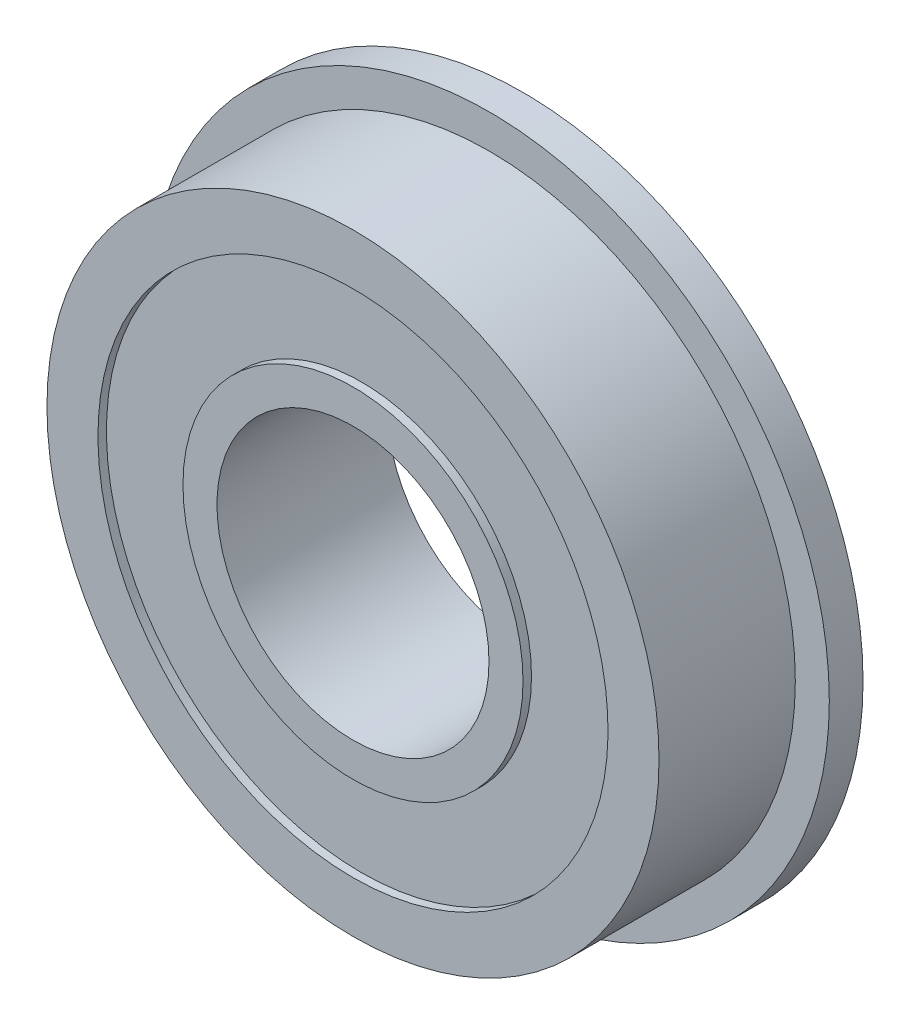
ISO-10303-21;
HEADER;
FILE_DESCRIPTION(('STEP AP214'),'2;1');
FILE_NAME('part.step','',(''),(''),'','','');
FILE_SCHEMA(('AUTOMOTIVE_DESIGN { 1 0 10303 214 1 1 1 1 }'));
ENDSEC;
DATA;
#1=APPLICATION_CONTEXT('core data for automotive mechanical design processes');
#2=APPLICATION_PROTOCOL_DEFINITION('international standard','automotive_design',2000,#1);
#3=PRODUCT_CONTEXT('',#1,'mechanical');
#4=PRODUCT('Part','Part','',(#3));
#5=PRODUCT_RELATED_PRODUCT_CATEGORY('part','',(#4));
#6=PRODUCT_DEFINITION_FORMATION('','',#4);
#7=PRODUCT_DEFINITION_CONTEXT('part definition',#1,'design');
#8=PRODUCT_DEFINITION('design','',#6,#7);
#9=PRODUCT_DEFINITION_SHAPE('','',#8);
#10=(LENGTH_UNIT() NAMED_UNIT(*) SI_UNIT(.MILLI.,.METRE.));
#11=(NAMED_UNIT(*) PLANE_ANGLE_UNIT() SI_UNIT($,.RADIAN.));
#12=(NAMED_UNIT(*) SI_UNIT($,.STERADIAN.) SOLID_ANGLE_UNIT());
#13=UNCERTAINTY_MEASURE_WITH_UNIT(LENGTH_MEASURE(1.E-05),#10,'distance_accuracy_value','');
#14=(GEOMETRIC_REPRESENTATION_CONTEXT(3) GLOBAL_UNCERTAINTY_ASSIGNED_CONTEXT((#13)) GLOBAL_UNIT_ASSIGNED_CONTEXT((#10,
#11,#12)) REPRESENTATION_CONTEXT('',''));
#15=CARTESIAN_POINT('',(0.,0.,0.));
#16=DIRECTION('',(0.,0.,1.));
#17=DIRECTION('',(1.,0.,0.));
#18=AXIS2_PLACEMENT_3D('',#15,#16,#17);
#19=CARTESIAN_POINT('',(0.,0.,-3.96875));
#20=DIRECTION('',(0.,0.,-1.));
#21=DIRECTION('',(0.,-1.,0.));
#22=AXIS2_PLACEMENT_3D('',#19,#20,#21);
#23=CYLINDRICAL_SURFACE('',#22,7.9375);
#24=CARTESIAN_POINT('',(0.,0.,-3.571875));
#25=DIRECTION('',(0.,0.,1.));
#26=DIRECTION('',(1.,0.,0.));
#27=AXIS2_PLACEMENT_3D('',#24,#25,#26);
#28=CIRCLE('',#27,7.9375);
#29=CARTESIAN_POINT('',(7.9375,0.,-3.571875));
#30=VERTEX_POINT('',#29);
#31=EDGE_CURVE('E21',#30,#30,#28,.T.);
#32=ORIENTED_EDGE('',*,*,#31,.F.);
#33=EDGE_LOOP('',(#32));
#34=FACE_BOUND('',#33,.T.);
#35=CARTESIAN_POINT('',(0.,0.,-3.96875));
#36=DIRECTION('',(0.,0.,-1.));
#37=DIRECTION('',(0.,-1.,0.));
#38=AXIS2_PLACEMENT_3D('',#35,#36,#37);
#39=CIRCLE('',#38,7.9375);
#40=CARTESIAN_POINT('',(0.,-7.9375,-3.96875));
#41=VERTEX_POINT('',#40);
#42=EDGE_CURVE('E30',#41,#41,#39,.T.);
#43=ORIENTED_EDGE('',*,*,#42,.F.);
#44=EDGE_LOOP('',(#43));
#45=FACE_BOUND('',#44,.T.);
#46=ADVANCED_FACE('F13',(#34,#45),#23,.T.);
#47=CARTESIAN_POINT('',(0.,0.,-3.96875));
#48=DIRECTION('',(0.,0.,-1.));
#49=DIRECTION('',(0.,-1.,0.));
#50=AXIS2_PLACEMENT_3D('',#47,#48,#49);
#51=CYLINDRICAL_SURFACE('',#50,11.90625);
#52=CARTESIAN_POINT('',(0.,0.,-3.571875));
#53=DIRECTION('',(0.,0.,1.));
#54=DIRECTION('',(1.,0.,0.));
#55=AXIS2_PLACEMENT_3D('',#52,#53,#54);
#56=CIRCLE('',#55,11.90625);
#57=CARTESIAN_POINT('',(11.90625,0.,-3.571875));
#58=VERTEX_POINT('',#57);
#59=EDGE_CURVE('E8',#58,#58,#56,.T.);
#60=ORIENTED_EDGE('',*,*,#59,.T.);
#61=EDGE_LOOP('',(#60));
#62=FACE_BOUND('',#61,.T.);
#63=CARTESIAN_POINT('',(0.,0.,-3.96875));
#64=DIRECTION('',(0.,0.,1.));
#65=DIRECTION('',(1.,0.,0.));
#66=AXIS2_PLACEMENT_3D('',#63,#64,#65);
#67=CIRCLE('',#66,11.90625);
#68=CARTESIAN_POINT('',(11.90625,0.,-3.96875));
#69=VERTEX_POINT('',#68);
#70=EDGE_CURVE('E26',#69,#69,#67,.T.);
#71=ORIENTED_EDGE('',*,*,#70,.F.);
#72=EDGE_LOOP('',(#71));
#73=FACE_BOUND('',#72,.T.);
#74=ADVANCED_FACE('F66',(#62,#73),#51,.F.);
#75=CARTESIAN_POINT('',(0.,0.,-3.571875));
#76=DIRECTION('',(0.,0.,1.));
#77=DIRECTION('',(1.,0.,0.));
#78=AXIS2_PLACEMENT_3D('',#75,#76,#77);
#79=PLANE('',#78);
#80=ORIENTED_EDGE('',*,*,#31,.T.);
#81=EDGE_LOOP('',(#80));
#82=FACE_BOUND('',#81,.T.);
#83=ORIENTED_EDGE('',*,*,#59,.F.);
#84=EDGE_LOOP('',(#83));
#85=FACE_BOUND('',#84,.T.);
#86=ADVANCED_FACE('F73',(#82,#85),#79,.F.);
#87=CARTESIAN_POINT('',(0.,0.,-3.96875));
#88=DIRECTION('',(0.,0.,-1.));
#89=DIRECTION('',(-1.,0.,0.));
#90=AXIS2_PLACEMENT_3D('',#87,#88,#89);
#91=PLANE('',#90);
#92=CARTESIAN_POINT('',(0.,0.,-3.96875));
#93=DIRECTION('',(0.,0.,1.));
#94=DIRECTION('',(1.,0.,0.));
#95=AXIS2_PLACEMENT_3D('',#92,#93,#94);
#96=CIRCLE('',#95,15.875);
#97=CARTESIAN_POINT('',(15.875,0.,-3.96875));
#98=VERTEX_POINT('',#97);
#99=EDGE_CURVE('E34',#98,#98,#96,.T.);
#100=ORIENTED_EDGE('',*,*,#99,.F.);
#101=EDGE_LOOP('',(#100));
#102=FACE_BOUND('',#101,.T.);
#103=ORIENTED_EDGE('',*,*,#70,.T.);
#104=EDGE_LOOP('',(#103));
#105=FACE_BOUND('',#104,.T.);
#106=ADVANCED_FACE('F77',(#102,#105),#91,.T.);
#107=CARTESIAN_POINT('',(0.,0.,3.96875));
#108=DIRECTION('',(0.,0.,-1.));
#109=DIRECTION('',(0.,-1.,0.));
#110=AXIS2_PLACEMENT_3D('',#107,#108,#109);
#111=CYLINDRICAL_SURFACE('',#110,7.9375);
#112=CARTESIAN_POINT('',(0.,0.,3.571875));
#113=DIRECTION('',(0.,0.,1.));
#114=DIRECTION('',(1.,0.,0.));
#115=AXIS2_PLACEMENT_3D('',#112,#113,#114);
#116=CIRCLE('',#115,7.9375);
#117=CARTESIAN_POINT('',(7.9375,0.,3.571875));
#118=VERTEX_POINT('',#117);
#119=EDGE_CURVE('E33',#118,#118,#116,.T.);
#120=ORIENTED_EDGE('',*,*,#119,.T.);
#121=EDGE_LOOP('',(#120));
#122=FACE_BOUND('',#121,.T.);
#123=CARTESIAN_POINT('',(0.,0.,3.96875));
#124=DIRECTION('',(0.,0.,1.));
#125=DIRECTION('',(1.,0.,0.));
#126=AXIS2_PLACEMENT_3D('',#123,#124,#125);
#127=CIRCLE('',#126,7.9375);
#128=CARTESIAN_POINT('',(7.9375,0.,3.96875));
#129=VERTEX_POINT('',#128);
#130=EDGE_CURVE('E38',#129,#129,#127,.T.);
#131=ORIENTED_EDGE('',*,*,#130,.F.);
#132=EDGE_LOOP('',(#131));
#133=FACE_BOUND('',#132,.T.);
#134=ADVANCED_FACE('F80',(#122,#133),#111,.T.);
#135=CARTESIAN_POINT('',(0.,0.,3.96875));
#136=DIRECTION('',(0.,0.,-1.));
#137=DIRECTION('',(0.,-1.,0.));
#138=AXIS2_PLACEMENT_3D('',#135,#136,#137);
#139=CYLINDRICAL_SURFACE('',#138,11.90625);
#140=CARTESIAN_POINT('',(0.,0.,3.571875));
#141=DIRECTION('',(0.,0.,1.));
#142=DIRECTION('',(1.,0.,0.));
#143=AXIS2_PLACEMENT_3D('',#140,#141,#142);
#144=CIRCLE('',#143,11.90625);
#145=CARTESIAN_POINT('',(11.90625,0.,3.571875));
#146=VERTEX_POINT('',#145);
#147=EDGE_CURVE('E41',#146,#146,#144,.T.);
#148=ORIENTED_EDGE('',*,*,#147,.F.);
#149=EDGE_LOOP('',(#148));
#150=FACE_BOUND('',#149,.T.);
#151=CARTESIAN_POINT('',(0.,0.,3.96875));
#152=DIRECTION('',(0.,0.,-1.));
#153=DIRECTION('',(0.,-1.,0.));
#154=AXIS2_PLACEMENT_3D('',#151,#152,#153);
#155=CIRCLE('',#154,11.90625);
#156=CARTESIAN_POINT('',(0.,-11.90625,3.96875));
#157=VERTEX_POINT('',#156);
#158=EDGE_CURVE('E47',#157,#157,#155,.T.);
#159=ORIENTED_EDGE('',*,*,#158,.F.);
#160=EDGE_LOOP('',(#159));
#161=FACE_BOUND('',#160,.T.);
#162=ADVANCED_FACE('F86',(#150,#161),#139,.F.);
#163=CARTESIAN_POINT('',(0.,0.,3.571875));
#164=DIRECTION('',(0.,0.,-1.));
#165=DIRECTION('',(-1.,0.,0.));
#166=AXIS2_PLACEMENT_3D('',#163,#164,#165);
#167=PLANE('',#166);
#168=ORIENTED_EDGE('',*,*,#119,.F.);
#169=EDGE_LOOP('',(#168));
#170=FACE_BOUND('',#169,.T.);
#171=ORIENTED_EDGE('',*,*,#147,.T.);
#172=EDGE_LOOP('',(#171));
#173=FACE_BOUND('',#172,.T.);
#174=ADVANCED_FACE('F82',(#170,#173),#167,.F.);
#175=CARTESIAN_POINT('',(0.,0.,3.96875));
#176=DIRECTION('',(0.,0.,-1.));
#177=DIRECTION('',(-1.,0.,0.));
#178=AXIS2_PLACEMENT_3D('',#175,#176,#177);
#179=PLANE('',#178);
#180=CARTESIAN_POINT('',(0.,0.,3.96875));
#181=DIRECTION('',(0.,0.,1.));
#182=DIRECTION('',(1.,0.,0.));
#183=AXIS2_PLACEMENT_3D('',#180,#181,#182);
#184=CIRCLE('',#183,14.2875);
#185=CARTESIAN_POINT('',(14.2875,0.,3.96875));
#186=VERTEX_POINT('',#185);
#187=EDGE_CURVE('E46',#186,#186,#184,.T.);
#188=ORIENTED_EDGE('',*,*,#187,.T.);
#189=EDGE_LOOP('',(#188));
#190=FACE_BOUND('',#189,.T.);
#191=ORIENTED_EDGE('',*,*,#158,.T.);
#192=EDGE_LOOP('',(#191));
#193=FACE_BOUND('',#192,.T.);
#194=ADVANCED_FACE('F85',(#190,#193),#179,.F.);
#195=CARTESIAN_POINT('',(0.,0.,3.96875));
#196=DIRECTION('',(0.,0.,-1.));
#197=DIRECTION('',(0.,-1.,0.));
#198=AXIS2_PLACEMENT_3D('',#195,#196,#197);
#199=CYLINDRICAL_SURFACE('',#198,14.2875);
#200=CARTESIAN_POINT('',(0.,0.,-2.39395));
#201=DIRECTION('',(0.,0.,1.));
#202=DIRECTION('',(1.,0.,0.));
#203=AXIS2_PLACEMENT_3D('',#200,#201,#202);
#204=CIRCLE('',#203,14.2875);
#205=CARTESIAN_POINT('',(14.2875,0.,-2.39395));
#206=VERTEX_POINT('',#205);
#207=EDGE_CURVE('E50',#206,#206,#204,.T.);
#208=ORIENTED_EDGE('',*,*,#207,.T.);
#209=EDGE_LOOP('',(#208));
#210=FACE_BOUND('',#209,.T.);
#211=ORIENTED_EDGE('',*,*,#187,.F.);
#212=EDGE_LOOP('',(#211));
#213=FACE_BOUND('',#212,.T.);
#214=ADVANCED_FACE('F90',(#210,#213),#199,.T.);
#215=CARTESIAN_POINT('',(0.,0.,-2.39395));
#216=DIRECTION('',(0.,0.,-1.));
#217=DIRECTION('',(-1.,0.,0.));
#218=AXIS2_PLACEMENT_3D('',#215,#216,#217);
#219=PLANE('',#218);
#220=ORIENTED_EDGE('',*,*,#207,.F.);
#221=EDGE_LOOP('',(#220));
#222=FACE_BOUND('',#221,.T.);
#223=CARTESIAN_POINT('',(0.,0.,-2.39395));
#224=DIRECTION('',(0.,0.,-1.));
#225=DIRECTION('',(0.,-1.,0.));
#226=AXIS2_PLACEMENT_3D('',#223,#224,#225);
#227=CIRCLE('',#226,15.875);
#228=CARTESIAN_POINT('',(0.,-15.875,-2.39395));
#229=VERTEX_POINT('',#228);
#230=EDGE_CURVE('E37',#229,#229,#227,.T.);
#231=ORIENTED_EDGE('',*,*,#230,.F.);
#232=EDGE_LOOP('',(#231));
#233=FACE_BOUND('',#232,.T.);
#234=ADVANCED_FACE('F92',(#222,#233),#219,.F.);
#235=CARTESIAN_POINT('',(0.,0.,0.));
#236=DIRECTION('',(0.,0.,1.));
#237=DIRECTION('',(1.,0.,0.));
#238=AXIS2_PLACEMENT_3D('',#235,#236,#237);
#239=CYLINDRICAL_SURFACE('',#238,6.35);
#240=CARTESIAN_POINT('',(0.,0.,-3.96875));
#241=DIRECTION('',(0.,0.,1.));
#242=DIRECTION('',(1.,0.,0.));
#243=AXIS2_PLACEMENT_3D('',#240,#241,#242);
#244=CIRCLE('',#243,6.35);
#245=CARTESIAN_POINT('',(6.35,0.,-3.96875));
#246=VERTEX_POINT('',#245);
#247=EDGE_CURVE('E56',#246,#246,#244,.T.);
#248=ORIENTED_EDGE('',*,*,#247,.F.);
#249=EDGE_LOOP('',(#248));
#250=FACE_BOUND('',#249,.T.);
#251=CARTESIAN_POINT('',(0.,0.,3.96875));
#252=DIRECTION('',(0.,0.,-1.));
#253=DIRECTION('',(0.,-1.,0.));
#254=AXIS2_PLACEMENT_3D('',#251,#252,#253);
#255=CIRCLE('',#254,6.35);
#256=CARTESIAN_POINT('',(0.,-6.35,3.96875));
#257=VERTEX_POINT('',#256);
#258=EDGE_CURVE('E17',#257,#257,#255,.T.);
#259=ORIENTED_EDGE('',*,*,#258,.F.);
#260=EDGE_LOOP('',(#259));
#261=FACE_BOUND('',#260,.T.);
#262=ADVANCED_FACE('F95',(#250,#261),#239,.F.);
#263=CARTESIAN_POINT('',(0.,0.,-3.96875));
#264=DIRECTION('',(0.,0.,-1.));
#265=DIRECTION('',(-1.,0.,0.));
#266=AXIS2_PLACEMENT_3D('',#263,#264,#265);
#267=PLANE('',#266);
#268=ORIENTED_EDGE('',*,*,#42,.T.);
#269=EDGE_LOOP('',(#268));
#270=FACE_BOUND('',#269,.T.);
#271=ORIENTED_EDGE('',*,*,#247,.T.);
#272=EDGE_LOOP('',(#271));
#273=FACE_BOUND('',#272,.T.);
#274=ADVANCED_FACE('F63',(#270,#273),#267,.T.);
#275=CARTESIAN_POINT('',(0.,0.,0.));
#276=DIRECTION('',(0.,0.,1.));
#277=DIRECTION('',(1.,0.,0.));
#278=AXIS2_PLACEMENT_3D('',#275,#276,#277);
#279=CYLINDRICAL_SURFACE('',#278,15.875);
#280=ORIENTED_EDGE('',*,*,#230,.T.);
#281=EDGE_LOOP('',(#280));
#282=FACE_BOUND('',#281,.T.);
#283=ORIENTED_EDGE('',*,*,#99,.T.);
#284=EDGE_LOOP('',(#283));
#285=FACE_BOUND('',#284,.T.);
#286=ADVANCED_FACE('F15',(#282,#285),#279,.T.);
#287=CARTESIAN_POINT('',(0.,0.,3.96875));
#288=DIRECTION('',(0.,0.,-1.));
#289=DIRECTION('',(-1.,0.,0.));
#290=AXIS2_PLACEMENT_3D('',#287,#288,#289);
#291=PLANE('',#290);
#292=ORIENTED_EDGE('',*,*,#130,.T.);
#293=EDGE_LOOP('',(#292));
#294=FACE_BOUND('',#293,.T.);
#295=ORIENTED_EDGE('',*,*,#258,.T.);
#296=EDGE_LOOP('',(#295));
#297=FACE_BOUND('',#296,.T.);
#298=ADVANCED_FACE('F99',(#294,#297),#291,.F.);
#299=CLOSED_SHELL('',(#46,#74,#86,#106,#134,#162,#174,#194,#214,#234,#262,#274,#286,#298));
#300=MANIFOLD_SOLID_BREP('B1',#299);
#301=ADVANCED_BREP_SHAPE_REPRESENTATION('',(#18,#300),#14);
#302=SHAPE_DEFINITION_REPRESENTATION(#9,#301);
ENDSEC;
END-ISO-10303-21;
